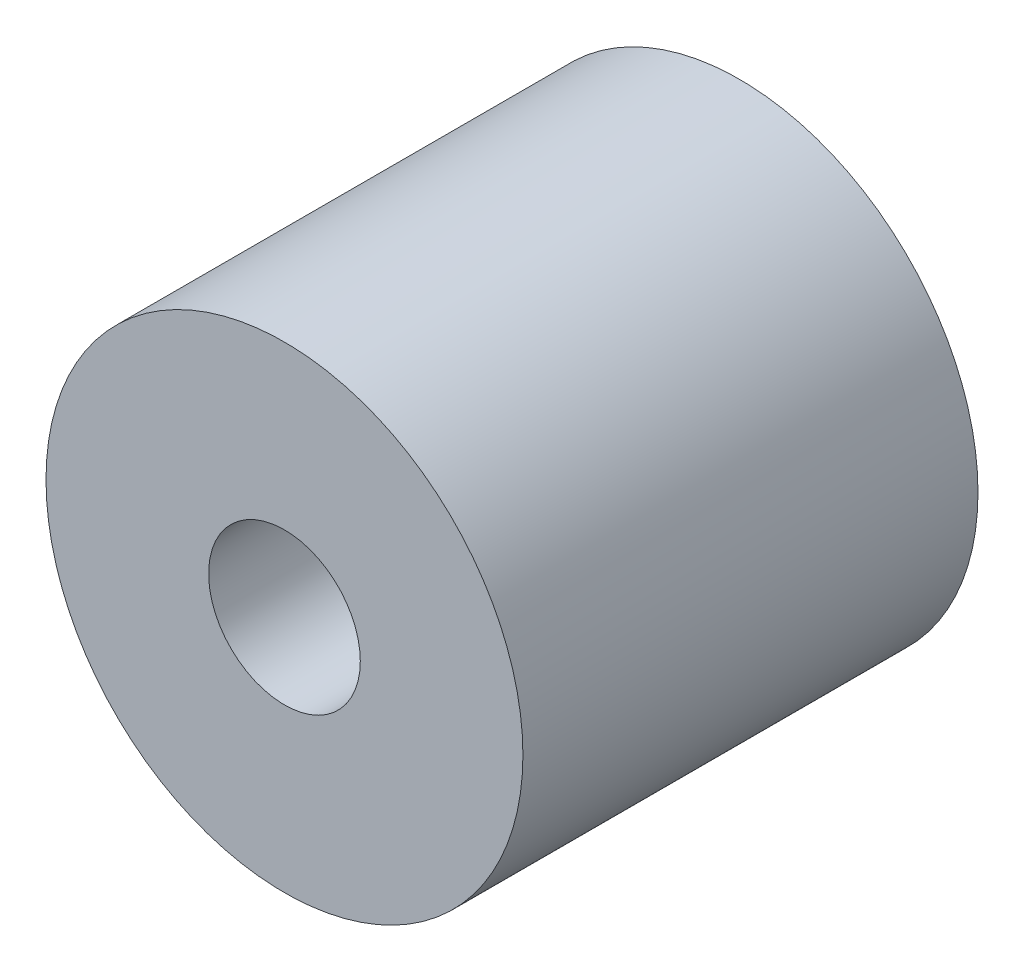
ISO-10303-21;
HEADER;
FILE_DESCRIPTION(('STEP AP214'),'2;1');
FILE_NAME('part.step','',(''),(''),'','','');
FILE_SCHEMA(('AUTOMOTIVE_DESIGN { 1 0 10303 214 1 1 1 1 }'));
ENDSEC;
DATA;
#1=APPLICATION_CONTEXT('core data for automotive mechanical design processes');
#2=APPLICATION_PROTOCOL_DEFINITION('international standard','automotive_design',2000,#1);
#3=PRODUCT_CONTEXT('',#1,'mechanical');
#4=PRODUCT('Part','Part','',(#3));
#5=PRODUCT_RELATED_PRODUCT_CATEGORY('part','',(#4));
#6=PRODUCT_DEFINITION_FORMATION('','',#4);
#7=PRODUCT_DEFINITION_CONTEXT('part definition',#1,'design');
#8=PRODUCT_DEFINITION('design','',#6,#7);
#9=PRODUCT_DEFINITION_SHAPE('','',#8);
#10=(LENGTH_UNIT() NAMED_UNIT(*) SI_UNIT(.MILLI.,.METRE.));
#11=(NAMED_UNIT(*) PLANE_ANGLE_UNIT() SI_UNIT($,.RADIAN.));
#12=(NAMED_UNIT(*) SI_UNIT($,.STERADIAN.) SOLID_ANGLE_UNIT());
#13=UNCERTAINTY_MEASURE_WITH_UNIT(LENGTH_MEASURE(1.E-05),#10,'distance_accuracy_value','');
#14=(GEOMETRIC_REPRESENTATION_CONTEXT(3) GLOBAL_UNCERTAINTY_ASSIGNED_CONTEXT((#13)) GLOBAL_UNIT_ASSIGNED_CONTEXT((#10,
#11,#12)) REPRESENTATION_CONTEXT('',''));
#15=CARTESIAN_POINT('',(0.,0.,0.));
#16=DIRECTION('',(0.,0.,1.));
#17=DIRECTION('',(1.,0.,0.));
#18=AXIS2_PLACEMENT_3D('',#15,#16,#17);
#19=CARTESIAN_POINT('',(0.,0.,9.525));
#20=DIRECTION('',(0.,0.,1.));
#21=DIRECTION('',(1.,0.,0.));
#22=AXIS2_PLACEMENT_3D('',#19,#20,#21);
#23=PLANE('',#22);
#24=CARTESIAN_POINT('',(0.,0.,9.525));
#25=DIRECTION('',(0.,0.,1.));
#26=DIRECTION('',(1.,0.,0.));
#27=AXIS2_PLACEMENT_3D('',#24,#25,#26);
#28=CIRCLE('',#27,4.9911);
#29=CARTESIAN_POINT('',(4.9911,0.,9.525));
#30=VERTEX_POINT('',#29);
#31=EDGE_CURVE('E10',#30,#30,#28,.T.);
#32=ORIENTED_EDGE('',*,*,#31,.T.);
#33=EDGE_LOOP('',(#32));
#34=FACE_BOUND('',#33,.T.);
#35=CARTESIAN_POINT('',(0.,0.,9.525));
#36=DIRECTION('',(0.,0.,1.));
#37=DIRECTION('',(1.,0.,0.));
#38=AXIS2_PLACEMENT_3D('',#35,#36,#37);
#39=CIRCLE('',#38,1.5875);
#40=CARTESIAN_POINT('',(1.5875,0.,9.525));
#41=VERTEX_POINT('',#40);
#42=EDGE_CURVE('E42',#41,#41,#39,.T.);
#43=ORIENTED_EDGE('',*,*,#42,.F.);
#44=EDGE_LOOP('',(#43));
#45=FACE_BOUND('',#44,.T.);
#46=ADVANCED_FACE('F31',(#34,#45),#23,.T.);
#47=CARTESIAN_POINT('',(0.,0.,0.));
#48=DIRECTION('',(0.,0.,1.));
#49=DIRECTION('',(1.,0.,0.));
#50=AXIS2_PLACEMENT_3D('',#47,#48,#49);
#51=PLANE('',#50);
#52=CARTESIAN_POINT('',(0.,0.,0.));
#53=DIRECTION('',(0.,0.,1.));
#54=DIRECTION('',(1.,0.,0.));
#55=AXIS2_PLACEMENT_3D('',#52,#53,#54);
#56=CIRCLE('',#55,4.9911);
#57=CARTESIAN_POINT('',(4.9911,0.,0.));
#58=VERTEX_POINT('',#57);
#59=EDGE_CURVE('E35',#58,#58,#56,.T.);
#60=ORIENTED_EDGE('',*,*,#59,.F.);
#61=EDGE_LOOP('',(#60));
#62=FACE_BOUND('',#61,.T.);
#63=CARTESIAN_POINT('',(0.,0.,0.));
#64=DIRECTION('',(0.,0.,1.));
#65=DIRECTION('',(1.,0.,0.));
#66=AXIS2_PLACEMENT_3D('',#63,#64,#65);
#67=CIRCLE('',#66,1.5875);
#68=CARTESIAN_POINT('',(1.5875,0.,0.));
#69=VERTEX_POINT('',#68);
#70=EDGE_CURVE('E44',#69,#69,#67,.T.);
#71=ORIENTED_EDGE('',*,*,#70,.T.);
#72=EDGE_LOOP('',(#71));
#73=FACE_BOUND('',#72,.T.);
#74=ADVANCED_FACE('F54',(#62,#73),#51,.F.);
#75=CARTESIAN_POINT('',(0.,0.,9.525));
#76=DIRECTION('',(0.,0.,-1.));
#77=DIRECTION('',(-1.,0.,0.));
#78=AXIS2_PLACEMENT_3D('',#75,#76,#77);
#79=CYLINDRICAL_SURFACE('',#78,4.9911);
#80=ORIENTED_EDGE('',*,*,#31,.F.);
#81=EDGE_LOOP('',(#80));
#82=FACE_BOUND('',#81,.T.);
#83=ORIENTED_EDGE('',*,*,#59,.T.);
#84=EDGE_LOOP('',(#83));
#85=FACE_BOUND('',#84,.T.);
#86=ADVANCED_FACE('F33',(#82,#85),#79,.T.);
#87=CARTESIAN_POINT('',(0.,0.,9.525));
#88=DIRECTION('',(0.,0.,-1.));
#89=DIRECTION('',(-1.,0.,0.));
#90=AXIS2_PLACEMENT_3D('',#87,#88,#89);
#91=CYLINDRICAL_SURFACE('',#90,1.5875);
#92=ORIENTED_EDGE('',*,*,#42,.T.);
#93=EDGE_LOOP('',(#92));
#94=FACE_BOUND('',#93,.T.);
#95=ORIENTED_EDGE('',*,*,#70,.F.);
#96=EDGE_LOOP('',(#95));
#97=FACE_BOUND('',#96,.T.);
#98=ADVANCED_FACE('F50',(#94,#97),#91,.F.);
#99=CLOSED_SHELL('',(#46,#74,#86,#98));
#100=MANIFOLD_SOLID_BREP('B2',#99);
#101=ADVANCED_BREP_SHAPE_REPRESENTATION('',(#18,#100),#14);
#102=SHAPE_DEFINITION_REPRESENTATION(#9,#101);
ENDSEC;
END-ISO-10303-21;
